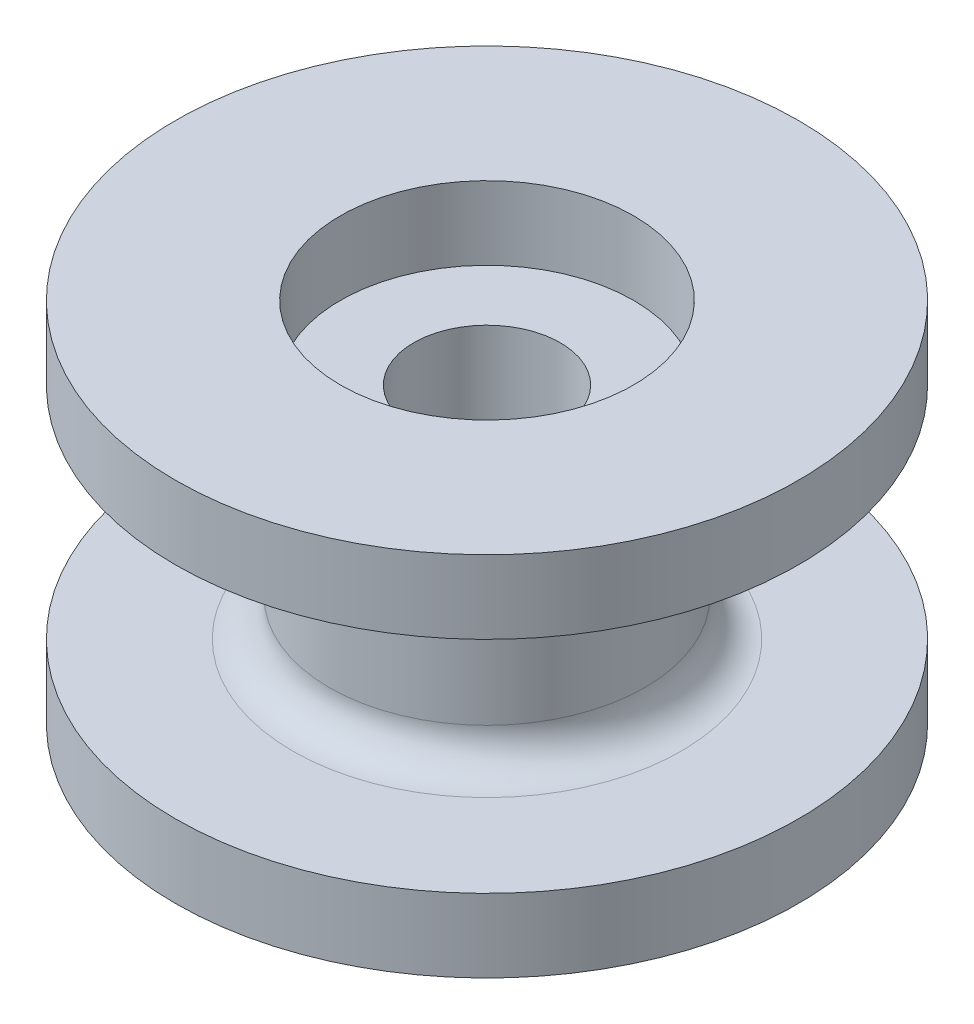
ISO-10303-21;
HEADER;
FILE_DESCRIPTION(('STEP AP214'),'2;1');
FILE_NAME('part.step','',(''),(''),'','','');
FILE_SCHEMA(('AUTOMOTIVE_DESIGN { 1 0 10303 214 1 1 1 1 }'));
ENDSEC;
DATA;
#1=APPLICATION_CONTEXT('core data for automotive mechanical design processes');
#2=APPLICATION_PROTOCOL_DEFINITION('international standard','automotive_design',2000,#1);
#3=PRODUCT_CONTEXT('',#1,'mechanical');
#4=PRODUCT('Part','Part','',(#3));
#5=PRODUCT_RELATED_PRODUCT_CATEGORY('part','',(#4));
#6=PRODUCT_DEFINITION_FORMATION('','',#4);
#7=PRODUCT_DEFINITION_CONTEXT('part definition',#1,'design');
#8=PRODUCT_DEFINITION('design','',#6,#7);
#9=PRODUCT_DEFINITION_SHAPE('','',#8);
#10=(LENGTH_UNIT() NAMED_UNIT(*) SI_UNIT(.MILLI.,.METRE.));
#11=(NAMED_UNIT(*) PLANE_ANGLE_UNIT() SI_UNIT($,.RADIAN.));
#12=(NAMED_UNIT(*) SI_UNIT($,.STERADIAN.) SOLID_ANGLE_UNIT());
#13=UNCERTAINTY_MEASURE_WITH_UNIT(LENGTH_MEASURE(1.E-05),#10,'distance_accuracy_value','');
#14=(GEOMETRIC_REPRESENTATION_CONTEXT(3) GLOBAL_UNCERTAINTY_ASSIGNED_CONTEXT((#13)) GLOBAL_UNIT_ASSIGNED_CONTEXT((#10,
#11,#12)) REPRESENTATION_CONTEXT('',''));
#15=CARTESIAN_POINT('',(0.,0.,0.));
#16=DIRECTION('',(0.,0.,1.));
#17=DIRECTION('',(1.,0.,0.));
#18=AXIS2_PLACEMENT_3D('',#15,#16,#17);
#19=CARTESIAN_POINT('',(0.,2.,0.));
#20=DIRECTION('',(0.,-1.,0.));
#21=DIRECTION('',(0.,0.,-1.));
#22=AXIS2_PLACEMENT_3D('',#19,#20,#21);
#23=CYLINDRICAL_SURFACE('',#22,8.5);
#24=CARTESIAN_POINT('',(0.,2.,0.));
#25=DIRECTION('',(0.,1.,0.));
#26=DIRECTION('',(0.,0.,1.));
#27=AXIS2_PLACEMENT_3D('',#24,#25,#26);
#28=CIRCLE('',#27,8.5);
#29=CARTESIAN_POINT('',(0.,2.,8.5));
#30=VERTEX_POINT('',#29);
#31=EDGE_CURVE('E51',#30,#30,#28,.T.);
#32=ORIENTED_EDGE('',*,*,#31,.F.);
#33=EDGE_LOOP('',(#32));
#34=FACE_BOUND('',#33,.T.);
#35=CARTESIAN_POINT('',(0.,0.,0.));
#36=DIRECTION('',(0.,1.,0.));
#37=DIRECTION('',(0.,0.,1.));
#38=AXIS2_PLACEMENT_3D('',#35,#36,#37);
#39=CIRCLE('',#38,8.5);
#40=CARTESIAN_POINT('',(0.,0.,8.5));
#41=VERTEX_POINT('',#40);
#42=EDGE_CURVE('E57',#41,#41,#39,.T.);
#43=ORIENTED_EDGE('',*,*,#42,.T.);
#44=EDGE_LOOP('',(#43));
#45=FACE_BOUND('',#44,.T.);
#46=ADVANCED_FACE('F31',(#34,#45),#23,.T.);
#47=CARTESIAN_POINT('',(0.,2.,0.));
#48=DIRECTION('',(0.,1.,0.));
#49=DIRECTION('',(0.,0.,1.));
#50=AXIS2_PLACEMENT_3D('',#47,#48,#49);
#51=PLANE('',#50);
#52=CARTESIAN_POINT('',(0.,2.,0.));
#53=DIRECTION('',(0.,1.,0.));
#54=DIRECTION('',(0.,0.,1.));
#55=AXIS2_PLACEMENT_3D('',#52,#53,#54);
#56=CIRCLE('',#55,5.3);
#57=CARTESIAN_POINT('',(0.,2.,5.3));
#58=VERTEX_POINT('',#57);
#59=EDGE_CURVE('E38',#58,#58,#56,.F.);
#60=ORIENTED_EDGE('',*,*,#59,.T.);
#61=EDGE_LOOP('',(#60));
#62=FACE_BOUND('',#61,.T.);
#63=ORIENTED_EDGE('',*,*,#31,.T.);
#64=EDGE_LOOP('',(#63));
#65=FACE_BOUND('',#64,.T.);
#66=ADVANCED_FACE('F110',(#62,#65),#51,.T.);
#67=CARTESIAN_POINT('',(0.,0.,0.));
#68=DIRECTION('',(0.,1.,0.));
#69=DIRECTION('',(0.,0.,1.));
#70=AXIS2_PLACEMENT_3D('',#67,#68,#69);
#71=PLANE('',#70);
#72=CARTESIAN_POINT('',(0.,0.,0.));
#73=DIRECTION('',(0.,1.,0.));
#74=DIRECTION('',(0.,0.,1.));
#75=AXIS2_PLACEMENT_3D('',#72,#73,#74);
#76=CIRCLE('',#75,2.);
#77=CARTESIAN_POINT('',(0.,0.,2.));
#78=VERTEX_POINT('',#77);
#79=EDGE_CURVE('E52',#78,#78,#76,.T.);
#80=ORIENTED_EDGE('',*,*,#79,.T.);
#81=EDGE_LOOP('',(#80));
#82=FACE_BOUND('',#81,.T.);
#83=ORIENTED_EDGE('',*,*,#42,.F.);
#84=EDGE_LOOP('',(#83));
#85=FACE_BOUND('',#84,.T.);
#86=ADVANCED_FACE('F116',(#82,#85),#71,.F.);
#87=CARTESIAN_POINT('',(0.,8.,0.));
#88=DIRECTION('',(0.,-1.,0.));
#89=DIRECTION('',(0.,0.,-1.));
#90=AXIS2_PLACEMENT_3D('',#87,#88,#89);
#91=CYLINDRICAL_SURFACE('',#90,4.3);
#92=CARTESIAN_POINT('',(0.,3.,0.));
#93=DIRECTION('',(0.,1.,0.));
#94=DIRECTION('',(0.,0.,1.));
#95=AXIS2_PLACEMENT_3D('',#92,#93,#94);
#96=CIRCLE('',#95,4.3);
#97=CARTESIAN_POINT('',(0.,3.,4.3));
#98=VERTEX_POINT('',#97);
#99=EDGE_CURVE('E42',#98,#98,#96,.T.);
#100=ORIENTED_EDGE('',*,*,#99,.T.);
#101=EDGE_LOOP('',(#100));
#102=FACE_BOUND('',#101,.T.);
#103=CARTESIAN_POINT('',(0.,7.,0.));
#104=DIRECTION('',(0.,1.,0.));
#105=DIRECTION('',(0.,0.,1.));
#106=AXIS2_PLACEMENT_3D('',#103,#104,#105);
#107=CIRCLE('',#106,4.3);
#108=CARTESIAN_POINT('',(0.,7.,4.3));
#109=VERTEX_POINT('',#108);
#110=EDGE_CURVE('E46',#109,#109,#107,.F.);
#111=ORIENTED_EDGE('',*,*,#110,.T.);
#112=EDGE_LOOP('',(#111));
#113=FACE_BOUND('',#112,.T.);
#114=ADVANCED_FACE('F101',(#102,#113),#91,.T.);
#115=CARTESIAN_POINT('',(0.,10.,0.));
#116=DIRECTION('',(0.,-1.,0.));
#117=DIRECTION('',(0.,0.,-1.));
#118=AXIS2_PLACEMENT_3D('',#115,#116,#117);
#119=CYLINDRICAL_SURFACE('',#118,8.5);
#120=CARTESIAN_POINT('',(0.,10.,0.));
#121=DIRECTION('',(0.,1.,0.));
#122=DIRECTION('',(0.,0.,1.));
#123=AXIS2_PLACEMENT_3D('',#120,#121,#122);
#124=CIRCLE('',#123,8.5);
#125=CARTESIAN_POINT('',(0.,10.,8.5));
#126=VERTEX_POINT('',#125);
#127=EDGE_CURVE('E60',#126,#126,#124,.T.);
#128=ORIENTED_EDGE('',*,*,#127,.F.);
#129=EDGE_LOOP('',(#128));
#130=FACE_BOUND('',#129,.T.);
#131=CARTESIAN_POINT('',(0.,8.,0.));
#132=DIRECTION('',(0.,1.,0.));
#133=DIRECTION('',(0.,0.,1.));
#134=AXIS2_PLACEMENT_3D('',#131,#132,#133);
#135=CIRCLE('',#134,8.5);
#136=CARTESIAN_POINT('',(0.,8.,8.5));
#137=VERTEX_POINT('',#136);
#138=EDGE_CURVE('E63',#137,#137,#135,.T.);
#139=ORIENTED_EDGE('',*,*,#138,.T.);
#140=EDGE_LOOP('',(#139));
#141=FACE_BOUND('',#140,.T.);
#142=ADVANCED_FACE('F95',(#130,#141),#119,.T.);
#143=CARTESIAN_POINT('',(0.,10.,0.));
#144=DIRECTION('',(0.,1.,0.));
#145=DIRECTION('',(0.,0.,1.));
#146=AXIS2_PLACEMENT_3D('',#143,#144,#145);
#147=PLANE('',#146);
#148=CARTESIAN_POINT('',(0.,10.,0.));
#149=DIRECTION('',(0.,1.,0.));
#150=DIRECTION('',(0.,0.,1.));
#151=AXIS2_PLACEMENT_3D('',#148,#149,#150);
#152=CIRCLE('',#151,4.);
#153=CARTESIAN_POINT('',(0.,10.,4.));
#154=VERTEX_POINT('',#153);
#155=EDGE_CURVE('E55',#154,#154,#152,.T.);
#156=ORIENTED_EDGE('',*,*,#155,.F.);
#157=EDGE_LOOP('',(#156));
#158=FACE_BOUND('',#157,.T.);
#159=ORIENTED_EDGE('',*,*,#127,.T.);
#160=EDGE_LOOP('',(#159));
#161=FACE_BOUND('',#160,.T.);
#162=ADVANCED_FACE('F92',(#158,#161),#147,.T.);
#163=CARTESIAN_POINT('',(0.,8.,0.));
#164=DIRECTION('',(0.,1.,0.));
#165=DIRECTION('',(0.,0.,1.));
#166=AXIS2_PLACEMENT_3D('',#163,#164,#165);
#167=PLANE('',#166);
#168=CARTESIAN_POINT('',(0.,8.,0.));
#169=DIRECTION('',(0.,1.,0.));
#170=DIRECTION('',(0.,0.,1.));
#171=AXIS2_PLACEMENT_3D('',#168,#169,#170);
#172=CIRCLE('',#171,5.3);
#173=CARTESIAN_POINT('',(0.,8.,5.3));
#174=VERTEX_POINT('',#173);
#175=EDGE_CURVE('E10',#174,#174,#172,.T.);
#176=ORIENTED_EDGE('',*,*,#175,.T.);
#177=EDGE_LOOP('',(#176));
#178=FACE_BOUND('',#177,.T.);
#179=ORIENTED_EDGE('',*,*,#138,.F.);
#180=EDGE_LOOP('',(#179));
#181=FACE_BOUND('',#180,.T.);
#182=ADVANCED_FACE('F88',(#178,#181),#167,.F.);
#183=CARTESIAN_POINT('',(0.,8.,0.));
#184=DIRECTION('',(0.,1.,0.));
#185=DIRECTION('',(0.,0.,1.));
#186=AXIS2_PLACEMENT_3D('',#183,#184,#185);
#187=CYLINDRICAL_SURFACE('',#186,4.);
#188=CARTESIAN_POINT('',(0.,8.,0.));
#189=DIRECTION('',(0.,1.,0.));
#190=DIRECTION('',(0.,0.,1.));
#191=AXIS2_PLACEMENT_3D('',#188,#189,#190);
#192=CIRCLE('',#191,4.);
#193=CARTESIAN_POINT('',(0.,8.,4.));
#194=VERTEX_POINT('',#193);
#195=EDGE_CURVE('E66',#194,#194,#192,.T.);
#196=ORIENTED_EDGE('',*,*,#195,.F.);
#197=EDGE_LOOP('',(#196));
#198=FACE_BOUND('',#197,.T.);
#199=ORIENTED_EDGE('',*,*,#155,.T.);
#200=EDGE_LOOP('',(#199));
#201=FACE_BOUND('',#200,.T.);
#202=ADVANCED_FACE('F82',(#198,#201),#187,.F.);
#203=CARTESIAN_POINT('',(0.,8.,0.));
#204=DIRECTION('',(0.,1.,0.));
#205=DIRECTION('',(0.,0.,1.));
#206=AXIS2_PLACEMENT_3D('',#203,#204,#205);
#207=PLANE('',#206);
#208=CARTESIAN_POINT('',(0.,8.,0.));
#209=DIRECTION('',(0.,1.,0.));
#210=DIRECTION('',(0.,0.,1.));
#211=AXIS2_PLACEMENT_3D('',#208,#209,#210);
#212=CIRCLE('',#211,2.);
#213=CARTESIAN_POINT('',(0.,8.,2.));
#214=VERTEX_POINT('',#213);
#215=EDGE_CURVE('E56',#214,#214,#212,.T.);
#216=ORIENTED_EDGE('',*,*,#215,.F.);
#217=EDGE_LOOP('',(#216));
#218=FACE_BOUND('',#217,.T.);
#219=ORIENTED_EDGE('',*,*,#195,.T.);
#220=EDGE_LOOP('',(#219));
#221=FACE_BOUND('',#220,.T.);
#222=ADVANCED_FACE('F79',(#218,#221),#207,.T.);
#223=CARTESIAN_POINT('',(0.,-3.,0.));
#224=DIRECTION('',(0.,1.,0.));
#225=DIRECTION('',(0.,0.,1.));
#226=AXIS2_PLACEMENT_3D('',#223,#224,#225);
#227=CYLINDRICAL_SURFACE('',#226,2.);
#228=ORIENTED_EDGE('',*,*,#215,.T.);
#229=EDGE_LOOP('',(#228));
#230=FACE_BOUND('',#229,.T.);
#231=ORIENTED_EDGE('',*,*,#79,.F.);
#232=EDGE_LOOP('',(#231));
#233=FACE_BOUND('',#232,.T.);
#234=ADVANCED_FACE('F76',(#230,#233),#227,.F.);
#235=CARTESIAN_POINT('',(0.,3.,0.));
#236=DIRECTION('',(0.,1.,0.));
#237=DIRECTION('',(0.,0.,1.));
#238=AXIS2_PLACEMENT_3D('',#235,#236,#237);
#239=TOROIDAL_SURFACE('',#238,5.3,1.);
#240=ORIENTED_EDGE('',*,*,#59,.F.);
#241=EDGE_LOOP('',(#240));
#242=FACE_BOUND('',#241,.T.);
#243=ORIENTED_EDGE('',*,*,#99,.F.);
#244=EDGE_LOOP('',(#243));
#245=FACE_BOUND('',#244,.T.);
#246=ADVANCED_FACE('F121',(#242,#245),#239,.F.);
#247=CARTESIAN_POINT('',(0.,7.,0.));
#248=DIRECTION('',(0.,1.,0.));
#249=DIRECTION('',(0.,0.,1.));
#250=AXIS2_PLACEMENT_3D('',#247,#248,#249);
#251=TOROIDAL_SURFACE('',#250,5.3,1.);
#252=ORIENTED_EDGE('',*,*,#110,.F.);
#253=EDGE_LOOP('',(#252));
#254=FACE_BOUND('',#253,.T.);
#255=ORIENTED_EDGE('',*,*,#175,.F.);
#256=EDGE_LOOP('',(#255));
#257=FACE_BOUND('',#256,.T.);
#258=ADVANCED_FACE('F33',(#254,#257),#251,.F.);
#259=CLOSED_SHELL('',(#46,#66,#86,#114,#142,#162,#182,#202,#222,#234,#246,#258));
#260=MANIFOLD_SOLID_BREP('B2',#259);
#261=ADVANCED_BREP_SHAPE_REPRESENTATION('',(#18,#260),#14);
#262=SHAPE_DEFINITION_REPRESENTATION(#9,#261);
ENDSEC;
END-ISO-10303-21;
